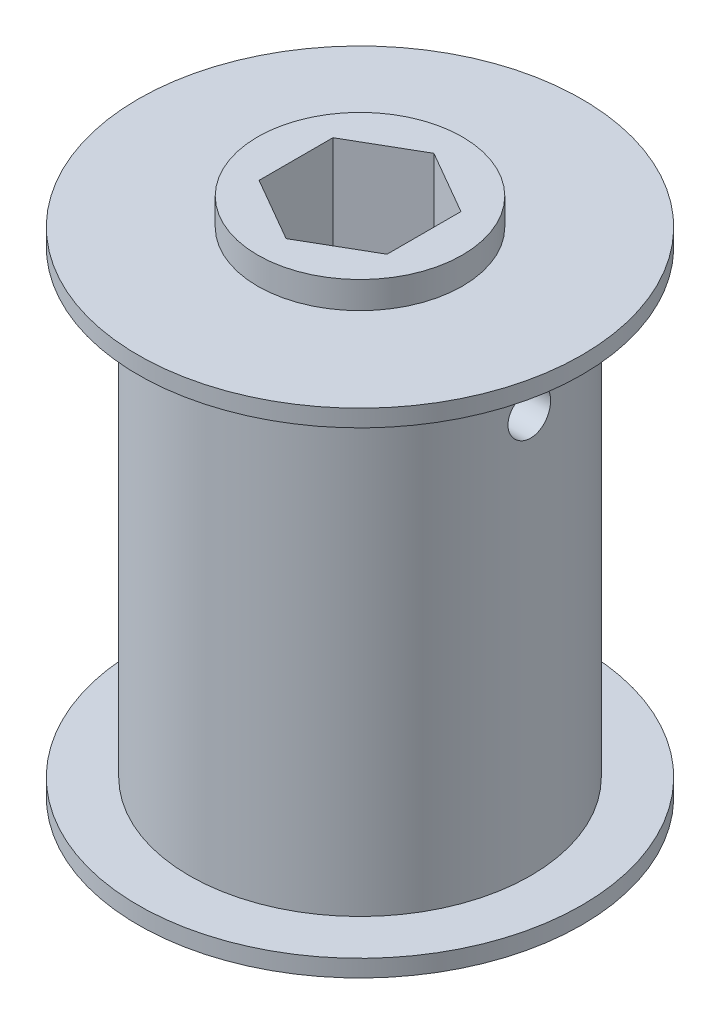
ISO-10303-21;
HEADER;
FILE_DESCRIPTION(('STEP AP214'),'2;1');
FILE_NAME('part.step','',(''),(''),'','','');
FILE_SCHEMA(('AUTOMOTIVE_DESIGN { 1 0 10303 214 1 1 1 1 }'));
ENDSEC;
DATA;
#1=APPLICATION_CONTEXT('core data for automotive mechanical design processes');
#2=APPLICATION_PROTOCOL_DEFINITION('international standard','automotive_design',2000,#1);
#3=PRODUCT_CONTEXT('',#1,'mechanical');
#4=PRODUCT('Part','Part','',(#3));
#5=PRODUCT_RELATED_PRODUCT_CATEGORY('part','',(#4));
#6=PRODUCT_DEFINITION_FORMATION('','',#4);
#7=PRODUCT_DEFINITION_CONTEXT('part definition',#1,'design');
#8=PRODUCT_DEFINITION('design','',#6,#7);
#9=PRODUCT_DEFINITION_SHAPE('','',#8);
#10=(LENGTH_UNIT() NAMED_UNIT(*) SI_UNIT(.MILLI.,.METRE.));
#11=(NAMED_UNIT(*) PLANE_ANGLE_UNIT() SI_UNIT($,.RADIAN.));
#12=(NAMED_UNIT(*) SI_UNIT($,.STERADIAN.) SOLID_ANGLE_UNIT());
#13=UNCERTAINTY_MEASURE_WITH_UNIT(LENGTH_MEASURE(1.E-05),#10,'distance_accuracy_value','');
#14=(GEOMETRIC_REPRESENTATION_CONTEXT(3) GLOBAL_UNCERTAINTY_ASSIGNED_CONTEXT((#13)) GLOBAL_UNIT_ASSIGNED_CONTEXT((#10,
#11,#12)) REPRESENTATION_CONTEXT('',''));
#15=CARTESIAN_POINT('',(0.,0.,0.));
#16=DIRECTION('',(0.,0.,1.));
#17=DIRECTION('',(1.,0.,0.));
#18=AXIS2_PLACEMENT_3D('',#15,#16,#17);
#19=CARTESIAN_POINT('',(0.,-20.3708,0.));
#20=DIRECTION('',(0.,-1.,0.));
#21=DIRECTION('',(1.,0.,0.));
#22=AXIS2_PLACEMENT_3D('',#19,#20,#21);
#23=PLANE('',#22);
#24=DIRECTION('',(-0.866025403784439,0.,-0.5));
#25=VECTOR('',#24,1.);
#26=CARTESIAN_POINT('',(4.7625,-20.3708,-2.7496306570156));
#27=LINE('',#26,#25);
#28=CARTESIAN_POINT('',(4.7625,-20.3708,-2.7496306570156));
#29=VERTEX_POINT('',#28);
#30=CARTESIAN_POINT('',(0.,-20.3708,-5.49926131403119));
#31=VERTEX_POINT('',#30);
#32=EDGE_CURVE('E95',#29,#31,#27,.T.);
#33=ORIENTED_EDGE('',*,*,#32,.T.);
#34=DIRECTION('',(-0.866025403784438,0.,0.5));
#35=VECTOR('',#34,1.);
#36=CARTESIAN_POINT('',(0.,-20.3708,-5.49926131403119));
#37=LINE('',#36,#35);
#38=CARTESIAN_POINT('',(-4.7625,-20.3708,-2.74963065701559));
#39=VERTEX_POINT('',#38);
#40=EDGE_CURVE('E104',#31,#39,#37,.T.);
#41=ORIENTED_EDGE('',*,*,#40,.T.);
#42=DIRECTION('',(0.,0.,1.));
#43=VECTOR('',#42,1.);
#44=CARTESIAN_POINT('',(-4.76249999999999,-20.3708,-2.74963065701559));
#45=LINE('',#44,#43);
#46=CARTESIAN_POINT('',(-4.76249999999999,-20.3708,2.7496306570156));
#47=VERTEX_POINT('',#46);
#48=EDGE_CURVE('E55',#39,#47,#45,.T.);
#49=ORIENTED_EDGE('',*,*,#48,.T.);
#50=DIRECTION('',(0.866025403784439,0.,0.5));
#51=VECTOR('',#50,1.);
#52=CARTESIAN_POINT('',(-4.76249999999999,-20.3708,2.7496306570156));
#53=LINE('',#52,#51);
#54=CARTESIAN_POINT('',(0.,-20.3708,5.49926131403118));
#55=VERTEX_POINT('',#54);
#56=EDGE_CURVE('E126',#47,#55,#53,.T.);
#57=ORIENTED_EDGE('',*,*,#56,.T.);
#58=DIRECTION('',(0.866025403784439,0.,-0.5));
#59=VECTOR('',#58,1.);
#60=CARTESIAN_POINT('',(0.,-20.3708,5.49926131403118));
#61=LINE('',#60,#59);
#62=CARTESIAN_POINT('',(4.76250000000001,-20.3708,2.74963065701559));
#63=VERTEX_POINT('',#62);
#64=EDGE_CURVE('E129',#55,#63,#61,.T.);
#65=ORIENTED_EDGE('',*,*,#64,.T.);
#66=DIRECTION('',(0.,0.,-1.));
#67=VECTOR('',#66,1.);
#68=CARTESIAN_POINT('',(4.76250000000001,-20.3708,2.74963065701559));
#69=LINE('',#68,#67);
#70=EDGE_CURVE('E101',#63,#29,#69,.T.);
#71=ORIENTED_EDGE('',*,*,#70,.T.);
#72=EDGE_LOOP('',(#33,#41,#49,#57,#65,#71));
#73=FACE_BOUND('',#72,.T.);
#74=CARTESIAN_POINT('',(0.,-20.3708,0.));
#75=DIRECTION('',(0.,1.,0.));
#76=DIRECTION('',(-1.,0.,0.));
#77=AXIS2_PLACEMENT_3D('',#74,#75,#76);
#78=CIRCLE('',#77,7.62);
#79=CARTESIAN_POINT('',(-7.61999999999999,-20.3708,0.));
#80=VERTEX_POINT('',#79);
#81=EDGE_CURVE('E11',#80,#80,#78,.T.);
#82=ORIENTED_EDGE('',*,*,#81,.F.);
#83=EDGE_LOOP('',(#82));
#84=FACE_BOUND('',#83,.T.);
#85=ADVANCED_FACE('F40',(#73,#84),#23,.T.);
#86=CARTESIAN_POINT('',(0.,20.3708,0.));
#87=DIRECTION('',(0.,1.,0.));
#88=DIRECTION('',(-1.,0.,0.));
#89=AXIS2_PLACEMENT_3D('',#86,#87,#88);
#90=CYLINDRICAL_SURFACE('',#89,7.62);
#91=ORIENTED_EDGE('',*,*,#81,.T.);
#92=EDGE_LOOP('',(#91));
#93=FACE_BOUND('',#92,.T.);
#94=CARTESIAN_POINT('',(0.,-18.3642,0.));
#95=DIRECTION('',(0.,1.,0.));
#96=DIRECTION('',(-1.,0.,0.));
#97=AXIS2_PLACEMENT_3D('',#94,#95,#96);
#98=CIRCLE('',#97,7.62);
#99=CARTESIAN_POINT('',(-7.61999999999999,-18.3642,0.));
#100=VERTEX_POINT('',#99);
#101=EDGE_CURVE('E48',#100,#100,#98,.T.);
#102=ORIENTED_EDGE('',*,*,#101,.F.);
#103=EDGE_LOOP('',(#102));
#104=FACE_BOUND('',#103,.T.);
#105=ADVANCED_FACE('F182',(#93,#104),#90,.T.);
#106=CARTESIAN_POINT('',(-16.51,-18.3642,0.));
#107=DIRECTION('',(0.,-1.,0.));
#108=DIRECTION('',(1.,0.,0.));
#109=AXIS2_PLACEMENT_3D('',#106,#107,#108);
#110=PLANE('',#109);
#111=ORIENTED_EDGE('',*,*,#101,.T.);
#112=EDGE_LOOP('',(#111));
#113=FACE_BOUND('',#112,.T.);
#114=CARTESIAN_POINT('',(0.,-18.3642,0.));
#115=DIRECTION('',(0.,1.,0.));
#116=DIRECTION('',(-1.,0.,0.));
#117=AXIS2_PLACEMENT_3D('',#114,#115,#116);
#118=CIRCLE('',#117,16.51);
#119=CARTESIAN_POINT('',(-16.51,-18.3642,0.));
#120=VERTEX_POINT('',#119);
#121=EDGE_CURVE('E173',#120,#120,#118,.T.);
#122=ORIENTED_EDGE('',*,*,#121,.F.);
#123=EDGE_LOOP('',(#122));
#124=FACE_BOUND('',#123,.T.);
#125=ADVANCED_FACE('F179',(#113,#124),#110,.T.);
#126=CARTESIAN_POINT('',(0.,20.3708,0.));
#127=DIRECTION('',(0.,1.,0.));
#128=DIRECTION('',(-1.,0.,0.));
#129=AXIS2_PLACEMENT_3D('',#126,#127,#128);
#130=CYLINDRICAL_SURFACE('',#129,16.51);
#131=ORIENTED_EDGE('',*,*,#121,.T.);
#132=EDGE_LOOP('',(#131));
#133=FACE_BOUND('',#132,.T.);
#134=CARTESIAN_POINT('',(0.,-17.0942,0.));
#135=DIRECTION('',(0.,1.,0.));
#136=DIRECTION('',(-1.,0.,0.));
#137=AXIS2_PLACEMENT_3D('',#134,#135,#136);
#138=CIRCLE('',#137,16.51);
#139=CARTESIAN_POINT('',(-16.51,-17.0942,0.));
#140=VERTEX_POINT('',#139);
#141=EDGE_CURVE('E170',#140,#140,#138,.T.);
#142=ORIENTED_EDGE('',*,*,#141,.F.);
#143=EDGE_LOOP('',(#142));
#144=FACE_BOUND('',#143,.T.);
#145=ADVANCED_FACE('F189',(#133,#144),#130,.T.);
#146=CARTESIAN_POINT('',(-12.7,-17.0942,0.));
#147=DIRECTION('',(0.,1.,0.));
#148=DIRECTION('',(-1.,0.,0.));
#149=AXIS2_PLACEMENT_3D('',#146,#147,#148);
#150=PLANE('',#149);
#151=ORIENTED_EDGE('',*,*,#141,.T.);
#152=EDGE_LOOP('',(#151));
#153=FACE_BOUND('',#152,.T.);
#154=CARTESIAN_POINT('',(0.,-17.0942,0.));
#155=DIRECTION('',(0.,1.,0.));
#156=DIRECTION('',(-1.,0.,0.));
#157=AXIS2_PLACEMENT_3D('',#154,#155,#156);
#158=CIRCLE('',#157,12.7);
#159=CARTESIAN_POINT('',(-12.7,-17.0942,0.));
#160=VERTEX_POINT('',#159);
#161=EDGE_CURVE('E167',#160,#160,#158,.T.);
#162=ORIENTED_EDGE('',*,*,#161,.F.);
#163=EDGE_LOOP('',(#162));
#164=FACE_BOUND('',#163,.T.);
#165=ADVANCED_FACE('F194',(#153,#164),#150,.T.);
#166=CARTESIAN_POINT('',(0.,20.3708,0.));
#167=DIRECTION('',(0.,1.,0.));
#168=DIRECTION('',(-1.,0.,0.));
#169=AXIS2_PLACEMENT_3D('',#166,#167,#168);
#170=CYLINDRICAL_SURFACE('',#169,12.7);
#171=CARTESIAN_POINT('',(-12.7,11.1125,0.));
#172=CARTESIAN_POINT('',(-12.6999987610923,11.1125037724942,0.0887990956779085));
#173=CARTESIAN_POINT('',(-12.6990588319236,11.1199757782725,0.177653679682244));
#174=CARTESIAN_POINT('',(-12.6953996797071,11.1496651241525,0.352890329326993));
#175=CARTESIAN_POINT('',(-12.6926785988531,11.1718978605814,0.439269714946078));
#176=CARTESIAN_POINT('',(-12.685763687632,11.2304434038854,0.606993690006289));
#177=CARTESIAN_POINT('',(-12.6815708487427,11.2667467335493,0.688341625692798));
#178=CARTESIAN_POINT('',(-12.6721787505759,11.3523822253208,0.843774966557078));
#179=CARTESIAN_POINT('',(-12.6669796639841,11.401712152417,0.917861614588296));
#180=CARTESIAN_POINT('',(-12.6561235402952,11.5122908881481,1.05709263875139));
#181=CARTESIAN_POINT('',(-12.6504643782968,11.5735970771349,1.12219128173507));
#182=CARTESIAN_POINT('',(-12.6393430601619,11.7062648929458,1.24120452390901));
#183=CARTESIAN_POINT('',(-12.6338809140791,11.7776270320199,1.29511855300908));
#184=CARTESIAN_POINT('',(-12.6237511406844,11.9286781857542,1.3904024524153));
#185=CARTESIAN_POINT('',(-12.6190862500797,12.0083944245956,1.43172948092258));
#186=CARTESIAN_POINT('',(-12.6111071657063,12.1737037779866,1.5003926536252));
#187=CARTESIAN_POINT('',(-12.6077929207184,12.2592966695384,1.52772932837141));
#188=CARTESIAN_POINT('',(-12.6029106564829,12.4334550641976,1.56749685231573));
#189=CARTESIAN_POINT('',(-12.6013335948233,12.5220026786422,1.58000491385463));
#190=CARTESIAN_POINT('',(-12.6000765787067,12.6999531773046,1.58999907396884));
#191=CARTESIAN_POINT('',(-12.6003965479596,12.7893560269844,1.58748577663653));
#192=CARTESIAN_POINT('',(-12.6028891665979,12.965941065303,1.56757194514442));
#193=CARTESIAN_POINT('',(-12.6050512310481,13.0531330162372,1.55025646449528));
#194=CARTESIAN_POINT('',(-12.6109679184609,13.2233638384741,1.5013624933206));
#195=CARTESIAN_POINT('',(-12.6147225736903,13.3064026255934,1.46978371381246));
#196=CARTESIAN_POINT('',(-12.6234133857405,13.4662341793788,1.3931681305439));
#197=CARTESIAN_POINT('',(-12.6283527798927,13.5430090456581,1.34809436610435));
#198=CARTESIAN_POINT('',(-12.6388540175843,13.6879372509524,1.24579473310514));
#199=CARTESIAN_POINT('',(-12.644415889589,13.7560901953933,1.18856830871129));
#200=CARTESIAN_POINT('',(-12.6555824478042,13.8823336213089,1.06311643532865));
#201=CARTESIAN_POINT('',(-12.6611871641568,13.9403512732714,0.994817674978408));
#202=CARTESIAN_POINT('',(-12.6717719167297,14.0441101388194,0.849412302387341));
#203=CARTESIAN_POINT('',(-12.6767519515096,14.0898513240967,0.77230566983709));
#204=CARTESIAN_POINT('',(-12.685529316588,14.1677588884946,0.61141716131581));
#205=CARTESIAN_POINT('',(-12.6893262494498,14.1999207072146,0.52763305403945));
#206=CARTESIAN_POINT('',(-12.6953059897034,14.2496987633873,0.35579554217372));
#207=CARTESIAN_POINT('',(-12.6974888726618,14.267315681807,0.267742337660474));
#208=CARTESIAN_POINT('',(-12.6999847372083,14.2874094644055,0.0904958590850708));
#209=CARTESIAN_POINT('',(-12.7003101095057,14.2899866551512,0.0013141262761153));
#210=CARTESIAN_POINT('',(-12.6990877463345,14.2801925888745,-0.17620998317591));
#211=CARTESIAN_POINT('',(-12.6975400507557,14.2678216501952,-0.264552377653589));
#212=CARTESIAN_POINT('',(-12.692753181605,14.2285658349283,-0.437594062403167));
#213=CARTESIAN_POINT('',(-12.6895195841681,14.2017287952393,-0.522304372219688));
#214=CARTESIAN_POINT('',(-12.6817229416863,14.1343523180353,-0.686022030835089));
#215=CARTESIAN_POINT('',(-12.677159851501,14.0938124152579,-0.765029185880475));
#216=CARTESIAN_POINT('',(-12.6671820754792,13.9999382576828,-0.915545870636515));
#217=CARTESIAN_POINT('',(-12.6617631196699,13.9465391059734,-0.987014637564324));
#218=CARTESIAN_POINT('',(-12.6506931537679,13.8285540690658,-1.12001108841271));
#219=CARTESIAN_POINT('',(-12.6450421344708,13.7639677398206,-1.1815383775439));
#220=CARTESIAN_POINT('',(-12.6341067196874,13.6249997903592,-1.29326129384944));
#221=CARTESIAN_POINT('',(-12.6288245944804,13.5505645000929,-1.34339041746064));
#222=CARTESIAN_POINT('',(-12.6192623600859,13.3942720145173,-1.43043458479663));
#223=CARTESIAN_POINT('',(-12.614982230812,13.3124149680324,-1.46734989341751));
#224=CARTESIAN_POINT('',(-12.6079240499955,13.1438171723413,-1.52681087758025));
#225=CARTESIAN_POINT('',(-12.6051420819234,13.0570898179195,-1.54939404843526));
#226=CARTESIAN_POINT('',(-12.6013839660123,12.8810369227993,-1.57967044610608));
#227=CARTESIAN_POINT('',(-12.6004077341657,12.791711503166,-1.58736436561021));
#228=CARTESIAN_POINT('',(-12.6003740688386,12.613659729955,-1.58763115041387));
#229=CARTESIAN_POINT('',(-12.6013033771749,12.5249335173093,-1.58030849653904));
#230=CARTESIAN_POINT('',(-12.6049475773112,12.3499834728659,-1.55097124707932));
#231=CARTESIAN_POINT('',(-12.6076624693026,12.2637596413364,-1.52895664992016));
#232=CARTESIAN_POINT('',(-12.6145678351684,12.0962756824533,-1.47089309179293));
#233=CARTESIAN_POINT('',(-12.6187577799142,12.0150137874111,-1.43484916291654));
#234=CARTESIAN_POINT('',(-12.6281420236046,11.8596748746793,-1.34976038286545));
#235=CARTESIAN_POINT('',(-12.6333363351336,11.7855979470324,-1.30071536878859));
#236=CARTESIAN_POINT('',(-12.6441873401767,11.6461976719088,-1.19062902035381));
#237=CARTESIAN_POINT('',(-12.6498468877336,11.5809360322936,-1.1295098223671));
#238=CARTESIAN_POINT('',(-12.6609654806149,11.4615551660183,-0.997172394124922));
#239=CARTESIAN_POINT('',(-12.66642447835,11.4074385701583,-0.925951786104895));
#240=CARTESIAN_POINT('',(-12.6765498093258,11.3117087982381,-0.775122669242423));
#241=CARTESIAN_POINT('',(-12.6812130492472,11.270143953254,-0.695483292543567));
#242=CARTESIAN_POINT('',(-12.6891900716372,11.2010372607482,-0.530341142961313));
#243=CARTESIAN_POINT('',(-12.6925053195968,11.1734801762656,-0.4448448563526));
#244=CARTESIAN_POINT('',(-12.6966136740812,11.1397673202612,-0.299088665199632));
#245=CARTESIAN_POINT('',(-12.6978773594361,11.1295567718414,-0.239747846333245));
#246=CARTESIAN_POINT('',(-12.6995709389403,11.1159218589848,-0.120279835139897));
#247=CARTESIAN_POINT('',(-12.700000839238,11.1124974445064,-0.0601526486149776));
#248=CARTESIAN_POINT('',(-12.7,11.1125,0.));
#249=B_SPLINE_CURVE_WITH_KNOTS('',3,(#171,#172,#173,#174,#175,#176,#177,#178,#179,#180,#181,
#182,#183,#184,#185,#186,#187,#188,#189,#190,#191,#192,#193,#194,#195,#196,#197,#198,#199,#200,
#201,#202,#203,#204,#205,#206,#207,#208,#209,#210,#211,#212,#213,#214,#215,#216,#217,#218,#219,
#220,#221,#222,#223,#224,#225,#226,#227,#228,#229,#230,#231,#232,#233,#234,#235,#236,#237,#238,
#239,#240,#241,#242,#243,#244,#245,#246,#247,#248),.UNSPECIFIED.,.T.,.F.,(4,2,2,2,2,2,2,2,2,2,2,
2,2,2,2,2,2,2,2,2,2,2,2,2,2,2,2,2,2,2,2,2,2,2,2,2,2,2,4),(0.,0.266177568212917,
0.532633212699076,0.798909697695425,1.06514052650331,1.3326796638317,1.60023243453007,
1.86868593952482,2.13712926330473,2.40416858056814,2.67119715876762,2.93670162240474,
3.20221146555563,3.46845525691314,3.7347112282616,4.00280808616625,4.27090556226827,
4.53909300289569,4.807267886739,5.0736517741387,5.34002998858725,5.60553269222306,
5.87104441155132,6.13792525859548,6.40481670123181,6.67322751907309,6.94163295580677,
7.20933327168387,7.47702113311745,7.74285282263406,8.00868454063513,8.2744209968862,
8.54016078294288,8.80767375934312,9.07524981028458,9.34384340928402,9.61214421664361,
9.79245465424144,9.97276376220777),.UNSPECIFIED.);
#250=CARTESIAN_POINT('',(-12.7,11.1125,0.));
#251=VERTEX_POINT('',#250);
#252=EDGE_CURVE('E117',#251,#251,#249,.T.);
#253=ORIENTED_EDGE('',*,*,#252,.F.);
#254=EDGE_LOOP('',(#253));
#255=FACE_BOUND('',#254,.T.);
#256=CARTESIAN_POINT('',(12.6003906189451,12.7,-1.5875));
#257=CARTESIAN_POINT('',(12.6003918944879,12.7887960402078,-1.58749622481956));
#258=CARTESIAN_POINT('',(12.6013393840053,12.8776475777146,-1.58002471587852));
#259=CARTESIAN_POINT('',(12.6050255327228,13.0528778981319,-1.55033752271305));
#260=CARTESIAN_POINT('',(12.6077660635828,13.1392539986156,-1.52810643139297));
#261=CARTESIAN_POINT('',(12.614723143474,13.3069710251437,-1.46956569994448));
#262=CARTESIAN_POINT('',(12.6189386905307,13.3883153252453,-1.43326561504688));
#263=CARTESIAN_POINT('',(12.6283696093514,13.5437425669077,-1.34763776600275));
#264=CARTESIAN_POINT('',(12.6335848101502,13.6178267468568,-1.29831222898299));
#265=CARTESIAN_POINT('',(12.6444601011988,13.7570605269226,-1.1877379409179));
#266=CARTESIAN_POINT('',(12.650122284808,13.8221636194725,-1.12643082754043));
#267=CARTESIAN_POINT('',(12.6612347287615,13.9411854582763,-0.993759290526229));
#268=CARTESIAN_POINT('',(12.6666849785516,13.9951036481001,-0.922394366826851));
#269=CARTESIAN_POINT('',(12.6767808732914,14.0903919229865,-0.771340742479242));
#270=CARTESIAN_POINT('',(12.6814237979272,14.1317199236383,-0.691625296681307));
#271=CARTESIAN_POINT('',(12.6893589046612,14.2003851119625,-0.526317665965506));
#272=CARTESIAN_POINT('',(12.6926511368908,14.2277228188983,-0.440725699294174));
#273=CARTESIAN_POINT('',(12.6974991712845,14.2674924633924,-0.266570261721955));
#274=CARTESIAN_POINT('',(12.6990639772082,14.2800017158627,-0.178024700886244));
#275=CARTESIAN_POINT('',(12.7003115927805,14.2899989694982,-7.82324359563277E-05));
#276=CARTESIAN_POINT('',(12.6999944764657,14.2874875615899,0.0893226413916802));
#277=CARTESIAN_POINT('',(12.6975212633395,14.267576746249,0.265915945798838));
#278=CARTESIAN_POINT('',(12.6953754375939,14.2502604894643,0.353117915660428));
#279=CARTESIAN_POINT('',(12.6894974552338,14.20136150284,0.523368374079914));
#280=CARTESIAN_POINT('',(12.6857652684622,14.1697785017841,0.606416783643691));
#281=CARTESIAN_POINT('',(12.6771162370802,14.0931541270823,0.766260097803536));
#282=CARTESIAN_POINT('',(12.6721962319046,14.0480767693413,0.84303757467873));
#283=CARTESIAN_POINT('',(12.6617220035645,13.9457694399928,0.987969482214613));
#284=CARTESIAN_POINT('',(12.6561677513189,13.8885389110375,1.05612351717302));
#285=CARTESIAN_POINT('',(12.6450018087743,13.76308409519,1.18236239954082));
#286=CARTESIAN_POINT('',(12.63938998536,13.6947873426879,1.24037524339746));
#287=CARTESIAN_POINT('',(12.6287788568227,13.5493877114431,1.34412536014694));
#288=CARTESIAN_POINT('',(12.6237795536196,13.4722848050983,1.38986259456129));
#289=CARTESIAN_POINT('',(12.6149595465907,13.3113973703179,1.46776730422504));
#290=CARTESIAN_POINT('',(12.6111393440166,13.2276100192297,1.49992901046258));
#291=CARTESIAN_POINT('',(12.6051198398493,13.0557654470105,1.54970585058724));
#292=CARTESIAN_POINT('',(12.6029204601406,12.967708431874,1.56732168551776));
#293=CARTESIAN_POINT('',(12.6004058937787,12.7904600794301,1.58741137426197));
#294=CARTESIAN_POINT('',(12.6000780982591,12.7012803993386,1.58998655966891));
#295=CARTESIAN_POINT('',(12.6013104661098,12.5237608746625,1.5801892153014));
#296=CARTESIAN_POINT('',(12.6028705892392,12.4354210122176,1.56781700412973));
#297=CARTESIAN_POINT('',(12.6076915008733,12.2623924401281,1.52856138648156));
#298=CARTESIAN_POINT('',(12.6109465376111,12.1776924243541,1.50172704717875));
#299=CARTESIAN_POINT('',(12.6187858493146,12.0139941616682,1.43435941163874));
#300=CARTESIAN_POINT('',(12.6233701709813,11.934996115202,1.39382563409908));
#301=CARTESIAN_POINT('',(12.633381714093,11.7844858011787,1.29996058406837));
#302=CARTESIAN_POINT('',(12.6388132588805,11.7130152675253,1.24656286093146));
#303=CARTESIAN_POINT('',(12.649893671149,11.5800145882513,1.12857962140429));
#304=CARTESIAN_POINT('',(12.6555425470767,11.5184848294638,1.06399366984018));
#305=CARTESIAN_POINT('',(12.6664598631622,11.4067563410427,0.925024677479661));
#306=CARTESIAN_POINT('',(12.6717259513445,11.3566241962852,0.850587892494316));
#307=CARTESIAN_POINT('',(12.6812491677507,11.2695747318025,0.694291589367935));
#308=CARTESIAN_POINT('',(12.685506316311,11.2326571457146,0.612432220883884));
#309=CARTESIAN_POINT('',(12.6925215456477,11.1731947053134,0.443835700553553));
#310=CARTESIAN_POINT('',(12.6952836371169,11.1506113690199,0.357112294734979));
#311=CARTESIAN_POINT('',(12.6990141922025,11.120333303341,0.181067746371504));
#312=CARTESIAN_POINT('',(12.6999827367006,11.1126379025695,0.0917467211531975));
#313=CARTESIAN_POINT('',(12.7000166878868,11.1123666993445,-0.0863074114233033));
#314=CARTESIAN_POINT('',(12.6990950181158,11.1196882250393,-0.175040377448857));
#315=CARTESIAN_POINT('',(12.6954777913529,11.1490255895286,-0.35000421582241));
#316=CARTESIAN_POINT('',(12.6927822355947,11.1710414181035,-0.436235089910504));
#317=CARTESIAN_POINT('',(12.6859187810964,11.2291102026121,-0.603733516296946));
#318=CARTESIAN_POINT('',(12.6817513981589,11.265158241402,-0.685002795701329));
#319=CARTESIAN_POINT('',(12.6724057422999,11.3502575347758,-0.840354769086456));
#320=CARTESIAN_POINT('',(12.6672274573608,11.3993089439462,-0.9144373776164));
#321=CARTESIAN_POINT('',(12.6563957814274,11.5094024417386,-1.05383759765622));
#322=CARTESIAN_POINT('',(12.6507395021211,11.5705209238875,-1.11909465527478));
#323=CARTESIAN_POINT('',(12.639612509736,11.7028550194583,-1.23846661045028));
#324=CARTESIAN_POINT('',(12.6341418409304,11.7740730212067,-1.29257886504887));
#325=CARTESIAN_POINT('',(12.6239829523563,11.9248999009128,-1.38830382899768));
#326=CARTESIAN_POINT('',(12.619297835727,12.0045401196088,-1.42986746231088));
#327=CARTESIAN_POINT('',(12.6112768990596,12.1696840302777,-1.49897165809803));
#328=CARTESIAN_POINT('',(12.6079396123271,12.2551812295577,-1.52652747222998));
#329=CARTESIAN_POINT('',(12.603802496306,12.4009340417726,-1.56023684411112));
#330=CARTESIAN_POINT('',(12.6025294146641,12.4602703242264,-1.57044582469172));
#331=CARTESIAN_POINT('',(12.6008230471599,12.579729253729,-1.5840786555));
#332=CARTESIAN_POINT('',(12.6003897549259,12.6398518948081,-1.58750255720807));
#333=CARTESIAN_POINT('',(12.6003906189451,12.7,-1.5875));
#334=B_SPLINE_CURVE_WITH_KNOTS('',3,(#256,#257,#258,#259,#260,#261,#262,#263,#264,#265,#266,
#267,#268,#269,#270,#271,#272,#273,#274,#275,#276,#277,#278,#279,#280,#281,#282,#283,#284,#285,
#286,#287,#288,#289,#290,#291,#292,#293,#294,#295,#296,#297,#298,#299,#300,#301,#302,#303,#304,
#305,#306,#307,#308,#309,#310,#311,#312,#313,#314,#315,#316,#317,#318,#319,#320,#321,#322,#323,
#324,#325,#326,#327,#328,#329,#330,#331,#332,#333),.UNSPECIFIED.,.T.,.F.,(4,2,2,2,2,2,2,2,2,2,2,
2,2,2,2,2,2,2,2,2,2,2,2,2,2,2,2,2,2,2,2,2,2,2,2,2,2,2,4),(0.,0.266168389099315,
0.532615061356762,0.798881087389064,1.06510161598639,1.33265276743657,1.60021722591538,
1.86866648202545,2.13710577365792,2.40413919057826,2.67116210223019,2.93669507232479,
3.20223309051586,3.46848559802131,3.73475031857882,4.00283487834884,4.27092027843335,
4.53911948879271,4.8073057724418,5.07368313306736,5.34005481597719,5.60552838945886,
5.87101129079527,6.13789615410511,6.40479140041705,6.67320792541638,6.94161903970138,
7.20930649058438,7.47698186955736,7.74283323343042,8.00868441241111,8.27444251600497,
8.54020377912298,8.80770481845681,9.07526922204292,9.3438668704257,9.61217144098581,
9.79246828416923,9.97276375938226),.UNSPECIFIED.);
#335=CARTESIAN_POINT('',(12.6003906189451,12.7,-1.5875));
#336=VERTEX_POINT('',#335);
#337=EDGE_CURVE('E206',#336,#336,#334,.T.);
#338=ORIENTED_EDGE('',*,*,#337,.F.);
#339=EDGE_LOOP('',(#338));
#340=FACE_BOUND('',#339,.T.);
#341=ORIENTED_EDGE('',*,*,#161,.T.);
#342=EDGE_LOOP('',(#341));
#343=FACE_BOUND('',#342,.T.);
#344=CARTESIAN_POINT('',(0.,17.0942,0.));
#345=DIRECTION('',(0.,1.,0.));
#346=DIRECTION('',(-1.,0.,0.));
#347=AXIS2_PLACEMENT_3D('',#344,#345,#346);
#348=CIRCLE('',#347,12.7);
#349=CARTESIAN_POINT('',(-12.7,17.0942,0.));
#350=VERTEX_POINT('',#349);
#351=EDGE_CURVE('E164',#350,#350,#348,.T.);
#352=ORIENTED_EDGE('',*,*,#351,.F.);
#353=EDGE_LOOP('',(#352));
#354=FACE_BOUND('',#353,.T.);
#355=ADVANCED_FACE('F197',(#255,#340,#343,#354),#170,.T.);
#356=CARTESIAN_POINT('',(-16.51,17.0942,0.));
#357=DIRECTION('',(0.,-1.,0.));
#358=DIRECTION('',(1.,0.,0.));
#359=AXIS2_PLACEMENT_3D('',#356,#357,#358);
#360=PLANE('',#359);
#361=ORIENTED_EDGE('',*,*,#351,.T.);
#362=EDGE_LOOP('',(#361));
#363=FACE_BOUND('',#362,.T.);
#364=CARTESIAN_POINT('',(0.,17.0942,0.));
#365=DIRECTION('',(0.,1.,0.));
#366=DIRECTION('',(-1.,0.,0.));
#367=AXIS2_PLACEMENT_3D('',#364,#365,#366);
#368=CIRCLE('',#367,16.51);
#369=CARTESIAN_POINT('',(-16.51,17.0942,0.));
#370=VERTEX_POINT('',#369);
#371=EDGE_CURVE('E161',#370,#370,#368,.T.);
#372=ORIENTED_EDGE('',*,*,#371,.F.);
#373=EDGE_LOOP('',(#372));
#374=FACE_BOUND('',#373,.T.);
#375=ADVANCED_FACE('F202',(#363,#374),#360,.T.);
#376=CARTESIAN_POINT('',(0.,20.3708,0.));
#377=DIRECTION('',(0.,1.,0.));
#378=DIRECTION('',(-1.,0.,0.));
#379=AXIS2_PLACEMENT_3D('',#376,#377,#378);
#380=CYLINDRICAL_SURFACE('',#379,16.51);
#381=ORIENTED_EDGE('',*,*,#371,.T.);
#382=EDGE_LOOP('',(#381));
#383=FACE_BOUND('',#382,.T.);
#384=CARTESIAN_POINT('',(0.,18.3642,0.));
#385=DIRECTION('',(0.,1.,0.));
#386=DIRECTION('',(-1.,0.,0.));
#387=AXIS2_PLACEMENT_3D('',#384,#385,#386);
#388=CIRCLE('',#387,16.51);
#389=CARTESIAN_POINT('',(-16.51,18.3642,0.));
#390=VERTEX_POINT('',#389);
#391=EDGE_CURVE('E158',#390,#390,#388,.T.);
#392=ORIENTED_EDGE('',*,*,#391,.F.);
#393=EDGE_LOOP('',(#392));
#394=FACE_BOUND('',#393,.T.);
#395=ADVANCED_FACE('F250',(#383,#394),#380,.T.);
#396=CARTESIAN_POINT('',(-7.62000000000001,18.3642,0.));
#397=DIRECTION('',(0.,1.,0.));
#398=DIRECTION('',(-1.,0.,0.));
#399=AXIS2_PLACEMENT_3D('',#396,#397,#398);
#400=PLANE('',#399);
#401=ORIENTED_EDGE('',*,*,#391,.T.);
#402=EDGE_LOOP('',(#401));
#403=FACE_BOUND('',#402,.T.);
#404=CARTESIAN_POINT('',(0.,18.3642,0.));
#405=DIRECTION('',(0.,1.,0.));
#406=DIRECTION('',(-1.,0.,0.));
#407=AXIS2_PLACEMENT_3D('',#404,#405,#406);
#408=CIRCLE('',#407,7.62);
#409=CARTESIAN_POINT('',(-7.62000000000001,18.3642,0.));
#410=VERTEX_POINT('',#409);
#411=EDGE_CURVE('E155',#410,#410,#408,.T.);
#412=ORIENTED_EDGE('',*,*,#411,.F.);
#413=EDGE_LOOP('',(#412));
#414=FACE_BOUND('',#413,.T.);
#415=ADVANCED_FACE('F247',(#403,#414),#400,.T.);
#416=CARTESIAN_POINT('',(0.,20.3708,0.));
#417=DIRECTION('',(0.,1.,0.));
#418=DIRECTION('',(-1.,0.,0.));
#419=AXIS2_PLACEMENT_3D('',#416,#417,#418);
#420=CYLINDRICAL_SURFACE('',#419,7.62);
#421=ORIENTED_EDGE('',*,*,#411,.T.);
#422=EDGE_LOOP('',(#421));
#423=FACE_BOUND('',#422,.T.);
#424=CARTESIAN_POINT('',(0.,20.3708,0.));
#425=DIRECTION('',(0.,1.,0.));
#426=DIRECTION('',(-1.,0.,0.));
#427=AXIS2_PLACEMENT_3D('',#424,#425,#426);
#428=CIRCLE('',#427,7.62);
#429=CARTESIAN_POINT('',(-7.62000000000001,20.3708,0.));
#430=VERTEX_POINT('',#429);
#431=EDGE_CURVE('E145',#430,#430,#428,.T.);
#432=ORIENTED_EDGE('',*,*,#431,.F.);
#433=EDGE_LOOP('',(#432));
#434=FACE_BOUND('',#433,.T.);
#435=ADVANCED_FACE('F243',(#423,#434),#420,.T.);
#436=CARTESIAN_POINT('',(0.,20.3708,0.));
#437=DIRECTION('',(0.,1.,0.));
#438=DIRECTION('',(-1.,0.,0.));
#439=AXIS2_PLACEMENT_3D('',#436,#437,#438);
#440=PLANE('',#439);
#441=DIRECTION('',(-0.866025403784439,0.,-0.5));
#442=VECTOR('',#441,1.);
#443=CARTESIAN_POINT('',(4.76249999999999,20.3708,-2.7496306570156));
#444=LINE('',#443,#442);
#445=CARTESIAN_POINT('',(4.76249999999999,20.3708,-2.7496306570156));
#446=VERTEX_POINT('',#445);
#447=CARTESIAN_POINT('',(0.,20.3708,-5.49926131403119));
#448=VERTEX_POINT('',#447);
#449=EDGE_CURVE('E63',#446,#448,#444,.T.);
#450=ORIENTED_EDGE('',*,*,#449,.F.);
#451=DIRECTION('',(0.,0.,-1.));
#452=VECTOR('',#451,1.);
#453=CARTESIAN_POINT('',(4.76249999999999,20.3708,2.74963065701559));
#454=LINE('',#453,#452);
#455=CARTESIAN_POINT('',(4.76249999999999,20.3708,2.74963065701559));
#456=VERTEX_POINT('',#455);
#457=EDGE_CURVE('E111',#456,#446,#454,.T.);
#458=ORIENTED_EDGE('',*,*,#457,.F.);
#459=DIRECTION('',(0.866025403784439,0.,-0.5));
#460=VECTOR('',#459,1.);
#461=CARTESIAN_POINT('',(0.,20.3708,5.49926131403118));
#462=LINE('',#461,#460);
#463=CARTESIAN_POINT('',(0.,20.3708,5.49926131403118));
#464=VERTEX_POINT('',#463);
#465=EDGE_CURVE('E114',#464,#456,#462,.T.);
#466=ORIENTED_EDGE('',*,*,#465,.F.);
#467=DIRECTION('',(0.866025403784439,0.,0.5));
#468=VECTOR('',#467,1.);
#469=CARTESIAN_POINT('',(-4.7625,20.3708,2.7496306570156));
#470=LINE('',#469,#468);
#471=CARTESIAN_POINT('',(-4.7625,20.3708,2.7496306570156));
#472=VERTEX_POINT('',#471);
#473=EDGE_CURVE('E138',#472,#464,#470,.T.);
#474=ORIENTED_EDGE('',*,*,#473,.F.);
#475=DIRECTION('',(0.,0.,1.));
#476=VECTOR('',#475,1.);
#477=CARTESIAN_POINT('',(-4.7625,20.3708,-2.74963065701559));
#478=LINE('',#477,#476);
#479=CARTESIAN_POINT('',(-4.7625,20.3708,-2.74963065701559));
#480=VERTEX_POINT('',#479);
#481=EDGE_CURVE('E135',#480,#472,#478,.T.);
#482=ORIENTED_EDGE('',*,*,#481,.F.);
#483=DIRECTION('',(-0.866025403784438,0.,0.5));
#484=VECTOR('',#483,1.);
#485=CARTESIAN_POINT('',(0.,20.3708,-5.49926131403119));
#486=LINE('',#485,#484);
#487=EDGE_CURVE('E133',#448,#480,#486,.T.);
#488=ORIENTED_EDGE('',*,*,#487,.F.);
#489=EDGE_LOOP('',(#450,#458,#466,#474,#482,#488));
#490=FACE_BOUND('',#489,.T.);
#491=ORIENTED_EDGE('',*,*,#431,.T.);
#492=EDGE_LOOP('',(#491));
#493=FACE_BOUND('',#492,.T.);
#494=ADVANCED_FACE('F240',(#490,#493),#440,.T.);
#495=CARTESIAN_POINT('',(4.7625,-20.3708,-2.7496306570156));
#496=DIRECTION('',(0.5,0.,-0.866025403784439));
#497=DIRECTION('',(-0.866025403784439,0.,-0.5));
#498=AXIS2_PLACEMENT_3D('',#495,#496,#497);
#499=PLANE('',#498);
#500=ORIENTED_EDGE('',*,*,#449,.T.);
#501=DIRECTION('',(0.,1.,0.));
#502=VECTOR('',#501,1.);
#503=CARTESIAN_POINT('',(0.,-20.3708,-5.49926131403119));
#504=LINE('',#503,#502);
#505=EDGE_CURVE('E91',#31,#448,#504,.T.);
#506=ORIENTED_EDGE('',*,*,#505,.F.);
#507=ORIENTED_EDGE('',*,*,#32,.F.);
#508=DIRECTION('',(0.,1.,0.));
#509=VECTOR('',#508,1.);
#510=CARTESIAN_POINT('',(4.7625,-20.3708,-2.7496306570156));
#511=LINE('',#510,#509);
#512=EDGE_CURVE('E143',#29,#446,#511,.T.);
#513=ORIENTED_EDGE('',*,*,#512,.T.);
#514=EDGE_LOOP('',(#500,#506,#507,#513));
#515=FACE_BOUND('',#514,.T.);
#516=ADVANCED_FACE('F93',(#515),#499,.F.);
#517=CARTESIAN_POINT('',(4.76250000000001,-20.3708,2.74963065701559));
#518=DIRECTION('',(1.,0.,0.));
#519=DIRECTION('',(0.,0.,-1.));
#520=AXIS2_PLACEMENT_3D('',#517,#518,#519);
#521=PLANE('',#520);
#522=CARTESIAN_POINT('',(4.7625,12.7,0.));
#523=DIRECTION('',(1.,0.,0.));
#524=DIRECTION('',(0.,0.,-1.));
#525=AXIS2_PLACEMENT_3D('',#522,#523,#524);
#526=CIRCLE('',#525,1.5875);
#527=CARTESIAN_POINT('',(4.76249999999999,12.7,-1.5875));
#528=VERTEX_POINT('',#527);
#529=EDGE_CURVE('E212',#528,#528,#526,.T.);
#530=ORIENTED_EDGE('',*,*,#529,.T.);
#531=EDGE_LOOP('',(#530));
#532=FACE_BOUND('',#531,.T.);
#533=ORIENTED_EDGE('',*,*,#457,.T.);
#534=ORIENTED_EDGE('',*,*,#512,.F.);
#535=ORIENTED_EDGE('',*,*,#70,.F.);
#536=DIRECTION('',(0.,1.,0.));
#537=VECTOR('',#536,1.);
#538=CARTESIAN_POINT('',(4.76250000000001,-20.3708,2.74963065701559));
#539=LINE('',#538,#537);
#540=EDGE_CURVE('E146',#63,#456,#539,.T.);
#541=ORIENTED_EDGE('',*,*,#540,.T.);
#542=EDGE_LOOP('',(#533,#534,#535,#541));
#543=FACE_BOUND('',#542,.T.);
#544=ADVANCED_FACE('F219',(#532,#543),#521,.F.);
#545=CARTESIAN_POINT('',(0.,-20.3708,5.49926131403118));
#546=DIRECTION('',(0.5,0.,0.866025403784438));
#547=DIRECTION('',(0.866025403784439,0.,-0.5));
#548=AXIS2_PLACEMENT_3D('',#545,#546,#547);
#549=PLANE('',#548);
#550=ORIENTED_EDGE('',*,*,#465,.T.);
#551=ORIENTED_EDGE('',*,*,#540,.F.);
#552=ORIENTED_EDGE('',*,*,#64,.F.);
#553=DIRECTION('',(0.,1.,0.));
#554=VECTOR('',#553,1.);
#555=CARTESIAN_POINT('',(0.,-20.3708,5.49926131403118));
#556=LINE('',#555,#554);
#557=EDGE_CURVE('E148',#55,#464,#556,.T.);
#558=ORIENTED_EDGE('',*,*,#557,.T.);
#559=EDGE_LOOP('',(#550,#551,#552,#558));
#560=FACE_BOUND('',#559,.T.);
#561=ADVANCED_FACE('F223',(#560),#549,.F.);
#562=CARTESIAN_POINT('',(-4.76249999999999,-20.3708,2.7496306570156));
#563=DIRECTION('',(-0.5,0.,0.866025403784439));
#564=DIRECTION('',(0.866025403784439,0.,0.5));
#565=AXIS2_PLACEMENT_3D('',#562,#563,#564);
#566=PLANE('',#565);
#567=ORIENTED_EDGE('',*,*,#473,.T.);
#568=ORIENTED_EDGE('',*,*,#557,.F.);
#569=ORIENTED_EDGE('',*,*,#56,.F.);
#570=DIRECTION('',(0.,1.,0.));
#571=VECTOR('',#570,1.);
#572=CARTESIAN_POINT('',(-4.76249999999999,-20.3708,2.7496306570156));
#573=LINE('',#572,#571);
#574=EDGE_CURVE('E150',#47,#472,#573,.T.);
#575=ORIENTED_EDGE('',*,*,#574,.T.);
#576=EDGE_LOOP('',(#567,#568,#569,#575));
#577=FACE_BOUND('',#576,.T.);
#578=ADVANCED_FACE('F227',(#577),#566,.F.);
#579=CARTESIAN_POINT('',(-4.76249999999999,-20.3708,-2.74963065701559));
#580=DIRECTION('',(-1.,0.,0.));
#581=DIRECTION('',(0.,0.,1.));
#582=AXIS2_PLACEMENT_3D('',#579,#580,#581);
#583=PLANE('',#582);
#584=CARTESIAN_POINT('',(-4.7625,12.7,0.));
#585=DIRECTION('',(-1.,0.,0.));
#586=DIRECTION('',(0.,0.,1.));
#587=AXIS2_PLACEMENT_3D('',#584,#585,#586);
#588=CIRCLE('',#587,1.5875);
#589=CARTESIAN_POINT('',(-4.7625,12.7,1.5875));
#590=VERTEX_POINT('',#589);
#591=EDGE_CURVE('E43',#590,#590,#588,.T.);
#592=ORIENTED_EDGE('',*,*,#591,.T.);
#593=EDGE_LOOP('',(#592));
#594=FACE_BOUND('',#593,.T.);
#595=ORIENTED_EDGE('',*,*,#481,.T.);
#596=ORIENTED_EDGE('',*,*,#574,.F.);
#597=ORIENTED_EDGE('',*,*,#48,.F.);
#598=DIRECTION('',(0.,1.,0.));
#599=VECTOR('',#598,1.);
#600=CARTESIAN_POINT('',(-4.76249999999999,-20.3708,-2.74963065701559));
#601=LINE('',#600,#599);
#602=EDGE_CURVE('E100',#39,#480,#601,.T.);
#603=ORIENTED_EDGE('',*,*,#602,.T.);
#604=EDGE_LOOP('',(#595,#596,#597,#603));
#605=FACE_BOUND('',#604,.T.);
#606=ADVANCED_FACE('F231',(#594,#605),#583,.F.);
#607=CARTESIAN_POINT('',(0.,-20.3708,-5.49926131403119));
#608=DIRECTION('',(-0.5,0.,-0.866025403784439));
#609=DIRECTION('',(-0.866025403784439,0.,0.5));
#610=AXIS2_PLACEMENT_3D('',#607,#608,#609);
#611=PLANE('',#610);
#612=ORIENTED_EDGE('',*,*,#487,.T.);
#613=ORIENTED_EDGE('',*,*,#602,.F.);
#614=ORIENTED_EDGE('',*,*,#40,.F.);
#615=ORIENTED_EDGE('',*,*,#505,.T.);
#616=EDGE_LOOP('',(#612,#613,#614,#615));
#617=FACE_BOUND('',#616,.T.);
#618=ADVANCED_FACE('F105',(#617),#611,.F.);
#619=CARTESIAN_POINT('',(-16.51,12.7,0.));
#620=DIRECTION('',(1.,0.,0.));
#621=DIRECTION('',(0.,0.,-1.));
#622=AXIS2_PLACEMENT_3D('',#619,#620,#621);
#623=CYLINDRICAL_SURFACE('',#622,1.5875);
#624=ORIENTED_EDGE('',*,*,#252,.T.);
#625=EDGE_LOOP('',(#624));
#626=FACE_BOUND('',#625,.T.);
#627=ORIENTED_EDGE('',*,*,#591,.F.);
#628=EDGE_LOOP('',(#627));
#629=FACE_BOUND('',#628,.T.);
#630=ADVANCED_FACE('F217',(#626,#629),#623,.F.);
#631=ORIENTED_EDGE('',*,*,#337,.T.);
#632=EDGE_LOOP('',(#631));
#633=FACE_BOUND('',#632,.T.);
#634=ORIENTED_EDGE('',*,*,#529,.F.);
#635=EDGE_LOOP('',(#634));
#636=FACE_BOUND('',#635,.T.);
#637=ADVANCED_FACE('F213',(#633,#636),#623,.F.);
#638=CLOSED_SHELL('',(#85,#105,#125,#145,#165,#355,#375,#395,#415,#435,#494,#516,#544,#561,#578,
#606,#618,#630,#637));
#639=MANIFOLD_SOLID_BREP('B2',#638);
#640=ADVANCED_BREP_SHAPE_REPRESENTATION('',(#18,#639),#14);
#641=SHAPE_DEFINITION_REPRESENTATION(#9,#640);
ENDSEC;
END-ISO-10303-21;
